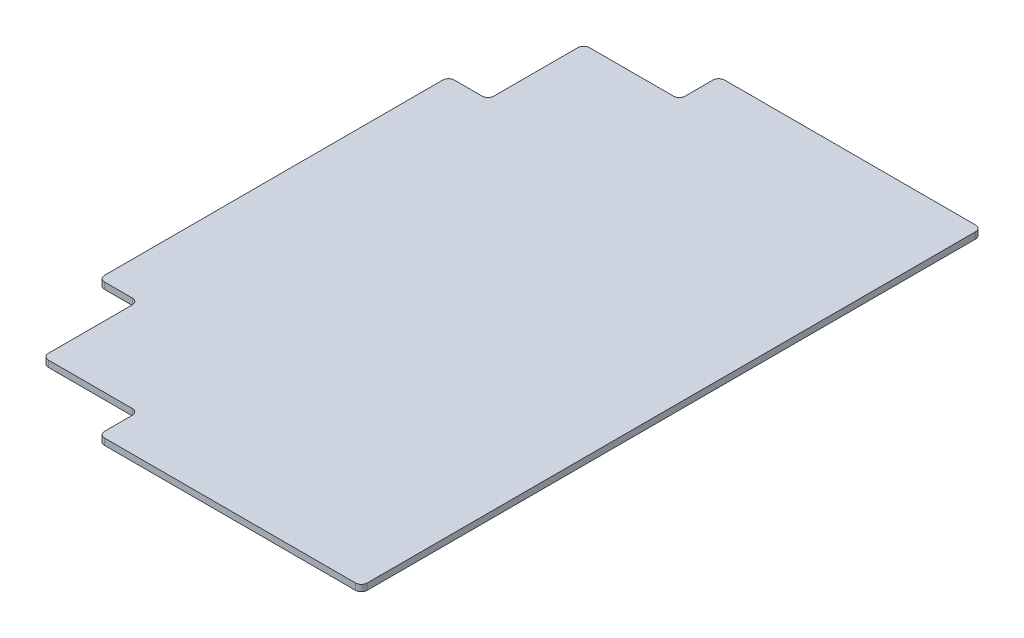
ISO-10303-21;
HEADER;
FILE_DESCRIPTION(('STEP AP214'),'2;1');
FILE_NAME('part.step','',(''),(''),'','','');
FILE_SCHEMA(('AUTOMOTIVE_DESIGN { 1 0 10303 214 1 1 1 1 }'));
ENDSEC;
DATA;
#1=APPLICATION_CONTEXT('core data for automotive mechanical design processes');
#2=APPLICATION_PROTOCOL_DEFINITION('international standard','automotive_design',2000,#1);
#3=PRODUCT_CONTEXT('',#1,'mechanical');
#4=PRODUCT('Part','Part','',(#3));
#5=PRODUCT_RELATED_PRODUCT_CATEGORY('part','',(#4));
#6=PRODUCT_DEFINITION_FORMATION('','',#4);
#7=PRODUCT_DEFINITION_CONTEXT('part definition',#1,'design');
#8=PRODUCT_DEFINITION('design','',#6,#7);
#9=PRODUCT_DEFINITION_SHAPE('','',#8);
#10=(LENGTH_UNIT() NAMED_UNIT(*) SI_UNIT(.MILLI.,.METRE.));
#11=(NAMED_UNIT(*) PLANE_ANGLE_UNIT() SI_UNIT($,.RADIAN.));
#12=(NAMED_UNIT(*) SI_UNIT($,.STERADIAN.) SOLID_ANGLE_UNIT());
#13=UNCERTAINTY_MEASURE_WITH_UNIT(LENGTH_MEASURE(1.E-05),#10,'distance_accuracy_value','');
#14=(GEOMETRIC_REPRESENTATION_CONTEXT(3) GLOBAL_UNCERTAINTY_ASSIGNED_CONTEXT((#13)) GLOBAL_UNIT_ASSIGNED_CONTEXT((#10,
#11,#12)) REPRESENTATION_CONTEXT('',''));
#15=CARTESIAN_POINT('',(0.,0.,0.));
#16=DIRECTION('',(0.,0.,1.));
#17=DIRECTION('',(1.,0.,0.));
#18=AXIS2_PLACEMENT_3D('',#15,#16,#17);
#19=CARTESIAN_POINT('',(190.5,2.778125,0.));
#20=DIRECTION('',(-1.,0.,0.));
#21=DIRECTION('',(0.,0.,1.));
#22=AXIS2_PLACEMENT_3D('',#19,#20,#21);
#23=PLANE('',#22);
#24=DIRECTION('',(0.,0.,-1.));
#25=VECTOR('',#24,1.);
#26=CARTESIAN_POINT('',(190.5,0.,0.));
#27=LINE('',#26,#25);
#28=CARTESIAN_POINT('',(190.5,0.,-20.32));
#29=VERTEX_POINT('',#28);
#30=CARTESIAN_POINT('',(190.5,0.,-284.48));
#31=VERTEX_POINT('',#30);
#32=EDGE_CURVE('E267',#29,#31,#27,.T.);
#33=ORIENTED_EDGE('',*,*,#32,.T.);
#34=DIRECTION('',(0.,1.,0.));
#35=VECTOR('',#34,1.);
#36=CARTESIAN_POINT('',(190.5,2.778125,-284.48));
#37=LINE('',#36,#35);
#38=CARTESIAN_POINT('',(190.5,2.778125,-284.48));
#39=VERTEX_POINT('',#38);
#40=EDGE_CURVE('E286',#31,#39,#37,.T.);
#41=ORIENTED_EDGE('',*,*,#40,.T.);
#42=DIRECTION('',(0.,0.,-1.));
#43=VECTOR('',#42,1.);
#44=CARTESIAN_POINT('',(190.5,2.778125,0.));
#45=LINE('',#44,#43);
#46=CARTESIAN_POINT('',(190.5,2.778125,-20.32));
#47=VERTEX_POINT('',#46);
#48=EDGE_CURVE('E276',#47,#39,#45,.T.);
#49=ORIENTED_EDGE('',*,*,#48,.F.);
#50=DIRECTION('',(0.,1.,0.));
#51=VECTOR('',#50,1.);
#52=CARTESIAN_POINT('',(190.5,2.778125,-20.32));
#53=LINE('',#52,#51);
#54=EDGE_CURVE('E284',#47,#29,#53,.F.);
#55=ORIENTED_EDGE('',*,*,#54,.T.);
#56=EDGE_LOOP('',(#33,#41,#49,#55));
#57=FACE_BOUND('',#56,.T.);
#58=ADVANCED_FACE('F33',(#57),#23,.F.);
#59=CARTESIAN_POINT('',(0.,2.778125,0.));
#60=DIRECTION('',(0.,-1.,0.));
#61=DIRECTION('',(0.,0.,-1.));
#62=AXIS2_PLACEMENT_3D('',#59,#60,#61);
#63=PLANE('',#62);
#64=ORIENTED_EDGE('',*,*,#48,.T.);
#65=CARTESIAN_POINT('',(187.96,2.778125,-284.48));
#66=DIRECTION('',(0.,-1.,0.));
#67=DIRECTION('',(0.,0.,-1.));
#68=AXIS2_PLACEMENT_3D('',#65,#66,#67);
#69=CIRCLE('',#68,2.54);
#70=CARTESIAN_POINT('',(187.96,2.778125,-287.02));
#71=VERTEX_POINT('',#70);
#72=EDGE_CURVE('E302',#39,#71,#69,.F.);
#73=ORIENTED_EDGE('',*,*,#72,.T.);
#74=DIRECTION('',(1.,0.,0.));
#75=VECTOR('',#74,1.);
#76=CARTESIAN_POINT('',(0.,2.778125,-287.02));
#77=LINE('',#76,#75);
#78=CARTESIAN_POINT('',(78.994,2.778125,-287.02));
#79=VERTEX_POINT('',#78);
#80=EDGE_CURVE('E259',#79,#71,#77,.T.);
#81=ORIENTED_EDGE('',*,*,#80,.F.);
#82=CARTESIAN_POINT('',(78.994,2.778125,-284.48));
#83=DIRECTION('',(0.,-1.,0.));
#84=DIRECTION('',(0.,0.,-1.));
#85=AXIS2_PLACEMENT_3D('',#82,#83,#84);
#86=CIRCLE('',#85,2.54);
#87=CARTESIAN_POINT('',(76.454,2.778125,-284.48));
#88=VERTEX_POINT('',#87);
#89=EDGE_CURVE('E290',#79,#88,#86,.F.);
#90=ORIENTED_EDGE('',*,*,#89,.T.);
#91=DIRECTION('',(0.,0.,-1.));
#92=VECTOR('',#91,1.);
#93=CARTESIAN_POINT('',(76.454,2.778125,-287.02));
#94=LINE('',#93,#92);
#95=CARTESIAN_POINT('',(76.454,2.778125,-272.415));
#96=VERTEX_POINT('',#95);
#97=EDGE_CURVE('E224',#96,#88,#94,.T.);
#98=ORIENTED_EDGE('',*,*,#97,.F.);
#99=CARTESIAN_POINT('',(73.914,2.778125,-272.415));
#100=DIRECTION('',(0.,-1.,0.));
#101=DIRECTION('',(0.,0.,-1.));
#102=AXIS2_PLACEMENT_3D('',#99,#100,#101);
#103=CIRCLE('',#102,2.54);
#104=CARTESIAN_POINT('',(73.914,2.778125,-269.875));
#105=VERTEX_POINT('',#104);
#106=EDGE_CURVE('E41',#96,#105,#103,.T.);
#107=ORIENTED_EDGE('',*,*,#106,.T.);
#108=DIRECTION('',(1.,0.,0.));
#109=VECTOR('',#108,1.);
#110=CARTESIAN_POINT('',(76.454,2.778125,-269.875));
#111=LINE('',#110,#109);
#112=CARTESIAN_POINT('',(37.465,2.778125,-269.875));
#113=VERTEX_POINT('',#112);
#114=EDGE_CURVE('E221',#113,#105,#111,.T.);
#115=ORIENTED_EDGE('',*,*,#114,.F.);
#116=CARTESIAN_POINT('',(37.465,2.778125,-267.335));
#117=DIRECTION('',(0.,-1.,0.));
#118=DIRECTION('',(0.,0.,-1.));
#119=AXIS2_PLACEMENT_3D('',#116,#117,#118);
#120=CIRCLE('',#119,2.54);
#121=CARTESIAN_POINT('',(34.925,2.778125,-267.335));
#122=VERTEX_POINT('',#121);
#123=EDGE_CURVE('E220',#113,#122,#120,.F.);
#124=ORIENTED_EDGE('',*,*,#123,.T.);
#125=DIRECTION('',(0.,0.,-1.));
#126=VECTOR('',#125,1.);
#127=CARTESIAN_POINT('',(34.925,2.778125,-269.875));
#128=LINE('',#127,#126);
#129=CARTESIAN_POINT('',(34.9250000000001,2.778125,-230.886));
#130=VERTEX_POINT('',#129);
#131=EDGE_CURVE('E211',#130,#122,#128,.T.);
#132=ORIENTED_EDGE('',*,*,#131,.F.);
#133=CARTESIAN_POINT('',(32.3850000000001,2.778125,-230.886));
#134=DIRECTION('',(0.,-1.,0.));
#135=DIRECTION('',(0.,0.,-1.));
#136=AXIS2_PLACEMENT_3D('',#133,#134,#135);
#137=CIRCLE('',#136,2.54);
#138=CARTESIAN_POINT('',(32.3850000000001,2.778125,-228.346));
#139=VERTEX_POINT('',#138);
#140=EDGE_CURVE('E195',#130,#139,#137,.T.);
#141=ORIENTED_EDGE('',*,*,#140,.T.);
#142=DIRECTION('',(1.,0.,0.));
#143=VECTOR('',#142,1.);
#144=CARTESIAN_POINT('',(34.9250000000001,2.778125,-228.346));
#145=LINE('',#144,#143);
#146=CARTESIAN_POINT('',(20.32,2.778125,-228.346));
#147=VERTEX_POINT('',#146);
#148=EDGE_CURVE('E222',#147,#139,#145,.T.);
#149=ORIENTED_EDGE('',*,*,#148,.F.);
#150=CARTESIAN_POINT('',(20.32,2.778125,-225.806));
#151=DIRECTION('',(0.,-1.,0.));
#152=DIRECTION('',(0.,0.,-1.));
#153=AXIS2_PLACEMENT_3D('',#150,#151,#152);
#154=CIRCLE('',#153,2.54);
#155=CARTESIAN_POINT('',(17.78,2.778125,-225.806));
#156=VERTEX_POINT('',#155);
#157=EDGE_CURVE('E292',#147,#156,#154,.F.);
#158=ORIENTED_EDGE('',*,*,#157,.T.);
#159=DIRECTION('',(0.,0.,-1.));
#160=VECTOR('',#159,1.);
#161=CARTESIAN_POINT('',(17.78,2.778125,-287.02));
#162=LINE('',#161,#160);
#163=CARTESIAN_POINT('',(17.78,2.778125,-78.994));
#164=VERTEX_POINT('',#163);
#165=EDGE_CURVE('E260',#164,#156,#162,.T.);
#166=ORIENTED_EDGE('',*,*,#165,.F.);
#167=CARTESIAN_POINT('',(20.32,2.778125,-78.994));
#168=DIRECTION('',(0.,-1.,0.));
#169=DIRECTION('',(0.,0.,-1.));
#170=AXIS2_PLACEMENT_3D('',#167,#168,#169);
#171=CIRCLE('',#170,2.54);
#172=CARTESIAN_POINT('',(20.32,2.778125,-76.454));
#173=VERTEX_POINT('',#172);
#174=EDGE_CURVE('E294',#164,#173,#171,.F.);
#175=ORIENTED_EDGE('',*,*,#174,.T.);
#176=DIRECTION('',(-1.,0.,0.));
#177=VECTOR('',#176,1.);
#178=CARTESIAN_POINT('',(34.925,2.778125,-76.454));
#179=LINE('',#178,#177);
#180=CARTESIAN_POINT('',(32.385,2.778125,-76.454));
#181=VERTEX_POINT('',#180);
#182=EDGE_CURVE('E237',#181,#173,#179,.T.);
#183=ORIENTED_EDGE('',*,*,#182,.F.);
#184=CARTESIAN_POINT('',(32.385,2.778125,-73.914));
#185=DIRECTION('',(0.,-1.,0.));
#186=DIRECTION('',(0.,0.,-1.));
#187=AXIS2_PLACEMENT_3D('',#184,#185,#186);
#188=CIRCLE('',#187,2.54);
#189=CARTESIAN_POINT('',(34.925,2.778125,-73.914));
#190=VERTEX_POINT('',#189);
#191=EDGE_CURVE('E368',#181,#190,#188,.T.);
#192=ORIENTED_EDGE('',*,*,#191,.T.);
#193=DIRECTION('',(0.,0.,-1.));
#194=VECTOR('',#193,1.);
#195=CARTESIAN_POINT('',(34.9250000000001,2.778125,-34.925));
#196=LINE('',#195,#194);
#197=CARTESIAN_POINT('',(34.9250000000001,2.778125,-37.465));
#198=VERTEX_POINT('',#197);
#199=EDGE_CURVE('E251',#198,#190,#196,.T.);
#200=ORIENTED_EDGE('',*,*,#199,.F.);
#201=CARTESIAN_POINT('',(37.4650000000001,2.778125,-37.465));
#202=DIRECTION('',(0.,-1.,0.));
#203=DIRECTION('',(0.,0.,-1.));
#204=AXIS2_PLACEMENT_3D('',#201,#202,#203);
#205=CIRCLE('',#204,2.54);
#206=CARTESIAN_POINT('',(37.4650000000001,2.778125,-34.925));
#207=VERTEX_POINT('',#206);
#208=EDGE_CURVE('E296',#198,#207,#205,.F.);
#209=ORIENTED_EDGE('',*,*,#208,.T.);
#210=DIRECTION('',(-1.,0.,0.));
#211=VECTOR('',#210,1.);
#212=CARTESIAN_POINT('',(76.454,2.778125,-34.925));
#213=LINE('',#212,#211);
#214=CARTESIAN_POINT('',(73.914,2.778125,-34.925));
#215=VERTEX_POINT('',#214);
#216=EDGE_CURVE('E248',#215,#207,#213,.T.);
#217=ORIENTED_EDGE('',*,*,#216,.F.);
#218=CARTESIAN_POINT('',(73.914,2.778125,-32.385));
#219=DIRECTION('',(0.,-1.,0.));
#220=DIRECTION('',(0.,0.,-1.));
#221=AXIS2_PLACEMENT_3D('',#218,#219,#220);
#222=CIRCLE('',#221,2.54);
#223=CARTESIAN_POINT('',(76.454,2.778125,-32.385));
#224=VERTEX_POINT('',#223);
#225=EDGE_CURVE('E364',#215,#224,#222,.T.);
#226=ORIENTED_EDGE('',*,*,#225,.T.);
#227=DIRECTION('',(0.,0.,-1.));
#228=VECTOR('',#227,1.);
#229=CARTESIAN_POINT('',(76.454,2.778125,-17.78));
#230=LINE('',#229,#228);
#231=CARTESIAN_POINT('',(76.454,2.778125,-20.32));
#232=VERTEX_POINT('',#231);
#233=EDGE_CURVE('E245',#232,#224,#230,.T.);
#234=ORIENTED_EDGE('',*,*,#233,.F.);
#235=CARTESIAN_POINT('',(78.994,2.778125,-20.32));
#236=DIRECTION('',(0.,-1.,0.));
#237=DIRECTION('',(0.,0.,-1.));
#238=AXIS2_PLACEMENT_3D('',#235,#236,#237);
#239=CIRCLE('',#238,2.54);
#240=CARTESIAN_POINT('',(78.994,2.778125,-17.78));
#241=VERTEX_POINT('',#240);
#242=EDGE_CURVE('E298',#232,#241,#239,.F.);
#243=ORIENTED_EDGE('',*,*,#242,.T.);
#244=DIRECTION('',(-1.,0.,0.));
#245=VECTOR('',#244,1.);
#246=CARTESIAN_POINT('',(0.,2.778125,-17.78));
#247=LINE('',#246,#245);
#248=CARTESIAN_POINT('',(187.96,2.778125,-17.78));
#249=VERTEX_POINT('',#248);
#250=EDGE_CURVE('E268',#249,#241,#247,.T.);
#251=ORIENTED_EDGE('',*,*,#250,.F.);
#252=CARTESIAN_POINT('',(187.96,2.778125,-20.32));
#253=DIRECTION('',(0.,-1.,0.));
#254=DIRECTION('',(0.,0.,-1.));
#255=AXIS2_PLACEMENT_3D('',#252,#253,#254);
#256=CIRCLE('',#255,2.54);
#257=EDGE_CURVE('E300',#249,#47,#256,.F.);
#258=ORIENTED_EDGE('',*,*,#257,.T.);
#259=EDGE_LOOP('',(#64,#73,#81,#90,#98,#107,#115,#124,#132,#141,#149,#158,#166,#175,#183,#192,
#200,#209,#217,#226,#234,#243,#251,#258));
#260=FACE_BOUND('',#259,.T.);
#261=ADVANCED_FACE('F218',(#260),#63,.F.);
#262=CARTESIAN_POINT('',(0.,0.,0.));
#263=DIRECTION('',(0.,-1.,0.));
#264=DIRECTION('',(0.,0.,-1.));
#265=AXIS2_PLACEMENT_3D('',#262,#263,#264);
#266=PLANE('',#265);
#267=DIRECTION('',(1.,0.,0.));
#268=VECTOR('',#267,1.);
#269=CARTESIAN_POINT('',(0.,0.,-287.02));
#270=LINE('',#269,#268);
#271=CARTESIAN_POINT('',(78.994,0.,-287.02));
#272=VERTEX_POINT('',#271);
#273=CARTESIAN_POINT('',(187.96,0.,-287.02));
#274=VERTEX_POINT('',#273);
#275=EDGE_CURVE('E271',#272,#274,#270,.T.);
#276=ORIENTED_EDGE('',*,*,#275,.T.);
#277=CARTESIAN_POINT('',(187.96,0.,-284.48));
#278=DIRECTION('',(0.,-1.,0.));
#279=DIRECTION('',(0.,0.,-1.));
#280=AXIS2_PLACEMENT_3D('',#277,#278,#279);
#281=CIRCLE('',#280,2.54);
#282=EDGE_CURVE('E322',#274,#31,#281,.T.);
#283=ORIENTED_EDGE('',*,*,#282,.T.);
#284=ORIENTED_EDGE('',*,*,#32,.F.);
#285=CARTESIAN_POINT('',(187.96,0.,-20.32));
#286=DIRECTION('',(0.,-1.,0.));
#287=DIRECTION('',(0.,0.,-1.));
#288=AXIS2_PLACEMENT_3D('',#285,#286,#287);
#289=CIRCLE('',#288,2.54);
#290=CARTESIAN_POINT('',(187.96,0.,-17.78));
#291=VERTEX_POINT('',#290);
#292=EDGE_CURVE('E320',#29,#291,#289,.T.);
#293=ORIENTED_EDGE('',*,*,#292,.T.);
#294=DIRECTION('',(-1.,0.,0.));
#295=VECTOR('',#294,1.);
#296=CARTESIAN_POINT('',(0.,0.,-17.78));
#297=LINE('',#296,#295);
#298=CARTESIAN_POINT('',(78.994,0.,-17.78));
#299=VERTEX_POINT('',#298);
#300=EDGE_CURVE('E264',#291,#299,#297,.T.);
#301=ORIENTED_EDGE('',*,*,#300,.T.);
#302=CARTESIAN_POINT('',(78.994,0.,-20.32));
#303=DIRECTION('',(0.,-1.,0.));
#304=DIRECTION('',(0.,0.,-1.));
#305=AXIS2_PLACEMENT_3D('',#302,#303,#304);
#306=CIRCLE('',#305,2.54);
#307=CARTESIAN_POINT('',(76.454,0.,-20.32));
#308=VERTEX_POINT('',#307);
#309=EDGE_CURVE('E318',#299,#308,#306,.T.);
#310=ORIENTED_EDGE('',*,*,#309,.T.);
#311=DIRECTION('',(0.,0.,-1.));
#312=VECTOR('',#311,1.);
#313=CARTESIAN_POINT('',(76.454,0.,-17.78));
#314=LINE('',#313,#312);
#315=CARTESIAN_POINT('',(76.454,0.,-32.385));
#316=VERTEX_POINT('',#315);
#317=EDGE_CURVE('E233',#308,#316,#314,.T.);
#318=ORIENTED_EDGE('',*,*,#317,.T.);
#319=CARTESIAN_POINT('',(73.914,0.,-32.385));
#320=DIRECTION('',(0.,-1.,0.));
#321=DIRECTION('',(0.,0.,-1.));
#322=AXIS2_PLACEMENT_3D('',#319,#320,#321);
#323=CIRCLE('',#322,2.54);
#324=CARTESIAN_POINT('',(73.914,0.,-34.925));
#325=VERTEX_POINT('',#324);
#326=EDGE_CURVE('E366',#316,#325,#323,.F.);
#327=ORIENTED_EDGE('',*,*,#326,.T.);
#328=DIRECTION('',(-1.,0.,0.));
#329=VECTOR('',#328,1.);
#330=CARTESIAN_POINT('',(76.454,0.,-34.925));
#331=LINE('',#330,#329);
#332=CARTESIAN_POINT('',(37.4650000000001,0.,-34.925));
#333=VERTEX_POINT('',#332);
#334=EDGE_CURVE('E236',#325,#333,#331,.T.);
#335=ORIENTED_EDGE('',*,*,#334,.T.);
#336=CARTESIAN_POINT('',(37.4650000000001,0.,-37.465));
#337=DIRECTION('',(0.,-1.,0.));
#338=DIRECTION('',(0.,0.,-1.));
#339=AXIS2_PLACEMENT_3D('',#336,#337,#338);
#340=CIRCLE('',#339,2.54);
#341=CARTESIAN_POINT('',(34.9250000000001,0.,-37.465));
#342=VERTEX_POINT('',#341);
#343=EDGE_CURVE('E316',#333,#342,#340,.T.);
#344=ORIENTED_EDGE('',*,*,#343,.T.);
#345=DIRECTION('',(0.,0.,-1.));
#346=VECTOR('',#345,1.);
#347=CARTESIAN_POINT('',(34.9250000000001,0.,-34.925));
#348=LINE('',#347,#346);
#349=CARTESIAN_POINT('',(34.925,0.,-73.914));
#350=VERTEX_POINT('',#349);
#351=EDGE_CURVE('E240',#342,#350,#348,.T.);
#352=ORIENTED_EDGE('',*,*,#351,.T.);
#353=CARTESIAN_POINT('',(32.385,0.,-73.914));
#354=DIRECTION('',(0.,-1.,0.));
#355=DIRECTION('',(0.,0.,-1.));
#356=AXIS2_PLACEMENT_3D('',#353,#354,#355);
#357=CIRCLE('',#356,2.54);
#358=CARTESIAN_POINT('',(32.385,0.,-76.454));
#359=VERTEX_POINT('',#358);
#360=EDGE_CURVE('E370',#350,#359,#357,.F.);
#361=ORIENTED_EDGE('',*,*,#360,.T.);
#362=DIRECTION('',(-1.,0.,0.));
#363=VECTOR('',#362,1.);
#364=CARTESIAN_POINT('',(34.925,0.,-76.454));
#365=LINE('',#364,#363);
#366=CARTESIAN_POINT('',(20.32,0.,-76.454));
#367=VERTEX_POINT('',#366);
#368=EDGE_CURVE('E226',#359,#367,#365,.T.);
#369=ORIENTED_EDGE('',*,*,#368,.T.);
#370=CARTESIAN_POINT('',(20.32,0.,-78.994));
#371=DIRECTION('',(0.,-1.,0.));
#372=DIRECTION('',(0.,0.,-1.));
#373=AXIS2_PLACEMENT_3D('',#370,#371,#372);
#374=CIRCLE('',#373,2.54);
#375=CARTESIAN_POINT('',(17.78,0.,-78.994));
#376=VERTEX_POINT('',#375);
#377=EDGE_CURVE('E314',#367,#376,#374,.T.);
#378=ORIENTED_EDGE('',*,*,#377,.T.);
#379=DIRECTION('',(0.,0.,-1.));
#380=VECTOR('',#379,1.);
#381=CARTESIAN_POINT('',(17.78,0.,-287.02));
#382=LINE('',#381,#380);
#383=CARTESIAN_POINT('',(17.78,0.,-225.806));
#384=VERTEX_POINT('',#383);
#385=EDGE_CURVE('E256',#376,#384,#382,.T.);
#386=ORIENTED_EDGE('',*,*,#385,.T.);
#387=CARTESIAN_POINT('',(20.32,0.,-225.806));
#388=DIRECTION('',(0.,-1.,0.));
#389=DIRECTION('',(0.,0.,-1.));
#390=AXIS2_PLACEMENT_3D('',#387,#388,#389);
#391=CIRCLE('',#390,2.54);
#392=CARTESIAN_POINT('',(20.32,0.,-228.346));
#393=VERTEX_POINT('',#392);
#394=EDGE_CURVE('E312',#384,#393,#391,.T.);
#395=ORIENTED_EDGE('',*,*,#394,.T.);
#396=DIRECTION('',(1.,0.,0.));
#397=VECTOR('',#396,1.);
#398=CARTESIAN_POINT('',(34.9250000000001,0.,-228.346));
#399=LINE('',#398,#397);
#400=CARTESIAN_POINT('',(32.3850000000001,0.,-228.346));
#401=VERTEX_POINT('',#400);
#402=EDGE_CURVE('E232',#393,#401,#399,.T.);
#403=ORIENTED_EDGE('',*,*,#402,.T.);
#404=CARTESIAN_POINT('',(32.3850000000001,0.,-230.886));
#405=DIRECTION('',(0.,-1.,0.));
#406=DIRECTION('',(0.,0.,-1.));
#407=AXIS2_PLACEMENT_3D('',#404,#405,#406);
#408=CIRCLE('',#407,2.54);
#409=CARTESIAN_POINT('',(34.9250000000001,0.,-230.886));
#410=VERTEX_POINT('',#409);
#411=EDGE_CURVE('E205',#401,#410,#408,.F.);
#412=ORIENTED_EDGE('',*,*,#411,.T.);
#413=DIRECTION('',(0.,0.,-1.));
#414=VECTOR('',#413,1.);
#415=CARTESIAN_POINT('',(34.925,0.,-269.875));
#416=LINE('',#415,#414);
#417=CARTESIAN_POINT('',(34.925,0.,-267.335));
#418=VERTEX_POINT('',#417);
#419=EDGE_CURVE('E213',#410,#418,#416,.T.);
#420=ORIENTED_EDGE('',*,*,#419,.T.);
#421=CARTESIAN_POINT('',(37.465,0.,-267.335));
#422=DIRECTION('',(0.,-1.,0.));
#423=DIRECTION('',(0.,0.,-1.));
#424=AXIS2_PLACEMENT_3D('',#421,#422,#423);
#425=CIRCLE('',#424,2.54);
#426=CARTESIAN_POINT('',(37.465,0.,-269.875));
#427=VERTEX_POINT('',#426);
#428=EDGE_CURVE('E55',#418,#427,#425,.T.);
#429=ORIENTED_EDGE('',*,*,#428,.T.);
#430=DIRECTION('',(1.,0.,0.));
#431=VECTOR('',#430,1.);
#432=CARTESIAN_POINT('',(76.454,0.,-269.875));
#433=LINE('',#432,#431);
#434=CARTESIAN_POINT('',(73.914,0.,-269.875));
#435=VERTEX_POINT('',#434);
#436=EDGE_CURVE('E382',#427,#435,#433,.T.);
#437=ORIENTED_EDGE('',*,*,#436,.T.);
#438=CARTESIAN_POINT('',(73.914,0.,-272.415));
#439=DIRECTION('',(0.,-1.,0.));
#440=DIRECTION('',(0.,0.,-1.));
#441=AXIS2_PLACEMENT_3D('',#438,#439,#440);
#442=CIRCLE('',#441,2.54);
#443=CARTESIAN_POINT('',(76.454,0.,-272.415));
#444=VERTEX_POINT('',#443);
#445=EDGE_CURVE('E11',#435,#444,#442,.F.);
#446=ORIENTED_EDGE('',*,*,#445,.T.);
#447=DIRECTION('',(0.,0.,-1.));
#448=VECTOR('',#447,1.);
#449=CARTESIAN_POINT('',(76.454,0.,-287.02));
#450=LINE('',#449,#448);
#451=CARTESIAN_POINT('',(76.454,0.,-284.48));
#452=VERTEX_POINT('',#451);
#453=EDGE_CURVE('E263',#444,#452,#450,.T.);
#454=ORIENTED_EDGE('',*,*,#453,.T.);
#455=CARTESIAN_POINT('',(78.994,0.,-284.48));
#456=DIRECTION('',(0.,-1.,0.));
#457=DIRECTION('',(0.,0.,-1.));
#458=AXIS2_PLACEMENT_3D('',#455,#456,#457);
#459=CIRCLE('',#458,2.54);
#460=EDGE_CURVE('E310',#452,#272,#459,.T.);
#461=ORIENTED_EDGE('',*,*,#460,.T.);
#462=EDGE_LOOP('',(#276,#283,#284,#293,#301,#310,#318,#327,#335,#344,#352,#361,#369,#378,#386,
#395,#403,#412,#420,#429,#437,#446,#454,#461));
#463=FACE_BOUND('',#462,.T.);
#464=ADVANCED_FACE('F380',(#463),#266,.T.);
#465=CARTESIAN_POINT('',(0.,0.,-287.02));
#466=DIRECTION('',(0.,0.,1.));
#467=DIRECTION('',(1.,0.,0.));
#468=AXIS2_PLACEMENT_3D('',#465,#466,#467);
#469=PLANE('',#468);
#470=ORIENTED_EDGE('',*,*,#80,.T.);
#471=DIRECTION('',(0.,1.,0.));
#472=VECTOR('',#471,1.);
#473=CARTESIAN_POINT('',(187.96,0.,-287.02));
#474=LINE('',#473,#472);
#475=EDGE_CURVE('E307',#71,#274,#474,.F.);
#476=ORIENTED_EDGE('',*,*,#475,.T.);
#477=ORIENTED_EDGE('',*,*,#275,.F.);
#478=DIRECTION('',(0.,1.,0.));
#479=VECTOR('',#478,1.);
#480=CARTESIAN_POINT('',(78.994,0.,-287.02));
#481=LINE('',#480,#479);
#482=EDGE_CURVE('E304',#272,#79,#481,.T.);
#483=ORIENTED_EDGE('',*,*,#482,.T.);
#484=EDGE_LOOP('',(#470,#476,#477,#483));
#485=FACE_BOUND('',#484,.T.);
#486=ADVANCED_FACE('F462',(#485),#469,.F.);
#487=CARTESIAN_POINT('',(0.,0.,-17.78));
#488=DIRECTION('',(0.,0.,-1.));
#489=DIRECTION('',(-1.,0.,0.));
#490=AXIS2_PLACEMENT_3D('',#487,#488,#489);
#491=PLANE('',#490);
#492=ORIENTED_EDGE('',*,*,#300,.F.);
#493=DIRECTION('',(0.,1.,0.));
#494=VECTOR('',#493,1.);
#495=CARTESIAN_POINT('',(187.96,0.,-17.78));
#496=LINE('',#495,#494);
#497=EDGE_CURVE('E326',#291,#249,#496,.T.);
#498=ORIENTED_EDGE('',*,*,#497,.T.);
#499=ORIENTED_EDGE('',*,*,#250,.T.);
#500=DIRECTION('',(0.,1.,0.));
#501=VECTOR('',#500,1.);
#502=CARTESIAN_POINT('',(78.994,0.,-17.78));
#503=LINE('',#502,#501);
#504=EDGE_CURVE('E324',#241,#299,#503,.F.);
#505=ORIENTED_EDGE('',*,*,#504,.T.);
#506=EDGE_LOOP('',(#492,#498,#499,#505));
#507=FACE_BOUND('',#506,.T.);
#508=ADVANCED_FACE('F446',(#507),#491,.F.);
#509=CARTESIAN_POINT('',(17.78,0.,-287.02));
#510=DIRECTION('',(1.,0.,0.));
#511=DIRECTION('',(0.,0.,-1.));
#512=AXIS2_PLACEMENT_3D('',#509,#510,#511);
#513=PLANE('',#512);
#514=ORIENTED_EDGE('',*,*,#385,.F.);
#515=DIRECTION('',(0.,1.,0.));
#516=VECTOR('',#515,1.);
#517=CARTESIAN_POINT('',(17.78,0.,-78.994));
#518=LINE('',#517,#516);
#519=EDGE_CURVE('E351',#376,#164,#518,.T.);
#520=ORIENTED_EDGE('',*,*,#519,.T.);
#521=ORIENTED_EDGE('',*,*,#165,.T.);
#522=DIRECTION('',(0.,1.,0.));
#523=VECTOR('',#522,1.);
#524=CARTESIAN_POINT('',(17.78,0.,-225.806));
#525=LINE('',#524,#523);
#526=EDGE_CURVE('E349',#156,#384,#525,.F.);
#527=ORIENTED_EDGE('',*,*,#526,.T.);
#528=EDGE_LOOP('',(#514,#520,#521,#527));
#529=FACE_BOUND('',#528,.T.);
#530=ADVANCED_FACE('F401',(#529),#513,.F.);
#531=CARTESIAN_POINT('',(34.925,0.,-76.454));
#532=DIRECTION('',(0.,0.,-1.));
#533=DIRECTION('',(-1.,0.,0.));
#534=AXIS2_PLACEMENT_3D('',#531,#532,#533);
#535=PLANE('',#534);
#536=ORIENTED_EDGE('',*,*,#368,.F.);
#537=DIRECTION('',(0.,1.,0.));
#538=VECTOR('',#537,1.);
#539=CARTESIAN_POINT('',(32.385,2.778125,-76.454));
#540=LINE('',#539,#538);
#541=EDGE_CURVE('E346',#359,#181,#540,.T.);
#542=ORIENTED_EDGE('',*,*,#541,.T.);
#543=ORIENTED_EDGE('',*,*,#182,.T.);
#544=DIRECTION('',(0.,1.,0.));
#545=VECTOR('',#544,1.);
#546=CARTESIAN_POINT('',(20.32,0.,-76.454));
#547=LINE('',#546,#545);
#548=EDGE_CURVE('E344',#173,#367,#547,.F.);
#549=ORIENTED_EDGE('',*,*,#548,.T.);
#550=EDGE_LOOP('',(#536,#542,#543,#549));
#551=FACE_BOUND('',#550,.T.);
#552=ADVANCED_FACE('F410',(#551),#535,.F.);
#553=CARTESIAN_POINT('',(34.9250000000001,0.,-34.925));
#554=DIRECTION('',(1.,0.,0.));
#555=DIRECTION('',(0.,0.,-1.));
#556=AXIS2_PLACEMENT_3D('',#553,#554,#555);
#557=PLANE('',#556);
#558=ORIENTED_EDGE('',*,*,#351,.F.);
#559=DIRECTION('',(0.,1.,0.));
#560=VECTOR('',#559,1.);
#561=CARTESIAN_POINT('',(34.9250000000001,0.,-37.465));
#562=LINE('',#561,#560);
#563=EDGE_CURVE('E341',#342,#198,#562,.T.);
#564=ORIENTED_EDGE('',*,*,#563,.T.);
#565=ORIENTED_EDGE('',*,*,#199,.T.);
#566=DIRECTION('',(0.,1.,0.));
#567=VECTOR('',#566,1.);
#568=CARTESIAN_POINT('',(34.925,0.,-73.914));
#569=LINE('',#568,#567);
#570=EDGE_CURVE('E339',#190,#350,#569,.F.);
#571=ORIENTED_EDGE('',*,*,#570,.T.);
#572=EDGE_LOOP('',(#558,#564,#565,#571));
#573=FACE_BOUND('',#572,.T.);
#574=ADVANCED_FACE('F419',(#573),#557,.F.);
#575=CARTESIAN_POINT('',(76.454,0.,-34.925));
#576=DIRECTION('',(0.,0.,-1.));
#577=DIRECTION('',(-1.,0.,0.));
#578=AXIS2_PLACEMENT_3D('',#575,#576,#577);
#579=PLANE('',#578);
#580=ORIENTED_EDGE('',*,*,#334,.F.);
#581=DIRECTION('',(0.,1.,0.));
#582=VECTOR('',#581,1.);
#583=CARTESIAN_POINT('',(73.914,2.778125,-34.925));
#584=LINE('',#583,#582);
#585=EDGE_CURVE('E336',#325,#215,#584,.T.);
#586=ORIENTED_EDGE('',*,*,#585,.T.);
#587=ORIENTED_EDGE('',*,*,#216,.T.);
#588=DIRECTION('',(0.,1.,0.));
#589=VECTOR('',#588,1.);
#590=CARTESIAN_POINT('',(37.4650000000001,0.,-34.925));
#591=LINE('',#590,#589);
#592=EDGE_CURVE('E334',#207,#333,#591,.F.);
#593=ORIENTED_EDGE('',*,*,#592,.T.);
#594=EDGE_LOOP('',(#580,#586,#587,#593));
#595=FACE_BOUND('',#594,.T.);
#596=ADVANCED_FACE('F428',(#595),#579,.F.);
#597=CARTESIAN_POINT('',(76.454,0.,-17.78));
#598=DIRECTION('',(1.,0.,0.));
#599=DIRECTION('',(0.,0.,-1.));
#600=AXIS2_PLACEMENT_3D('',#597,#598,#599);
#601=PLANE('',#600);
#602=ORIENTED_EDGE('',*,*,#317,.F.);
#603=DIRECTION('',(0.,1.,0.));
#604=VECTOR('',#603,1.);
#605=CARTESIAN_POINT('',(76.454,0.,-20.32));
#606=LINE('',#605,#604);
#607=EDGE_CURVE('E331',#308,#232,#606,.T.);
#608=ORIENTED_EDGE('',*,*,#607,.T.);
#609=ORIENTED_EDGE('',*,*,#233,.T.);
#610=DIRECTION('',(0.,1.,0.));
#611=VECTOR('',#610,1.);
#612=CARTESIAN_POINT('',(76.454,0.,-32.385));
#613=LINE('',#612,#611);
#614=EDGE_CURVE('E329',#224,#316,#613,.F.);
#615=ORIENTED_EDGE('',*,*,#614,.T.);
#616=EDGE_LOOP('',(#602,#608,#609,#615));
#617=FACE_BOUND('',#616,.T.);
#618=ADVANCED_FACE('F437',(#617),#601,.F.);
#619=CARTESIAN_POINT('',(76.454,0.,-287.02));
#620=DIRECTION('',(1.,0.,0.));
#621=DIRECTION('',(0.,0.,-1.));
#622=AXIS2_PLACEMENT_3D('',#619,#620,#621);
#623=PLANE('',#622);
#624=ORIENTED_EDGE('',*,*,#97,.T.);
#625=DIRECTION('',(0.,1.,0.));
#626=VECTOR('',#625,1.);
#627=CARTESIAN_POINT('',(76.454,0.,-284.48));
#628=LINE('',#627,#626);
#629=EDGE_CURVE('E357',#88,#452,#628,.F.);
#630=ORIENTED_EDGE('',*,*,#629,.T.);
#631=ORIENTED_EDGE('',*,*,#453,.F.);
#632=DIRECTION('',(0.,1.,0.));
#633=VECTOR('',#632,1.);
#634=CARTESIAN_POINT('',(76.454,2.778125,-272.415));
#635=LINE('',#634,#633);
#636=EDGE_CURVE('E354',#444,#96,#635,.T.);
#637=ORIENTED_EDGE('',*,*,#636,.T.);
#638=EDGE_LOOP('',(#624,#630,#631,#637));
#639=FACE_BOUND('',#638,.T.);
#640=ADVANCED_FACE('F384',(#639),#623,.F.);
#641=CARTESIAN_POINT('',(76.454,0.,-269.875));
#642=DIRECTION('',(0.,0.,1.));
#643=DIRECTION('',(1.,0.,0.));
#644=AXIS2_PLACEMENT_3D('',#641,#642,#643);
#645=PLANE('',#644);
#646=ORIENTED_EDGE('',*,*,#114,.T.);
#647=DIRECTION('',(0.,1.,0.));
#648=VECTOR('',#647,1.);
#649=CARTESIAN_POINT('',(73.914,0.,-269.875));
#650=LINE('',#649,#648);
#651=EDGE_CURVE('E48',#105,#435,#650,.F.);
#652=ORIENTED_EDGE('',*,*,#651,.T.);
#653=ORIENTED_EDGE('',*,*,#436,.F.);
#654=DIRECTION('',(0.,1.,0.));
#655=VECTOR('',#654,1.);
#656=CARTESIAN_POINT('',(37.465,0.,-269.875));
#657=LINE('',#656,#655);
#658=EDGE_CURVE('E359',#427,#113,#657,.T.);
#659=ORIENTED_EDGE('',*,*,#658,.T.);
#660=EDGE_LOOP('',(#646,#652,#653,#659));
#661=FACE_BOUND('',#660,.T.);
#662=ADVANCED_FACE('F374',(#661),#645,.F.);
#663=CARTESIAN_POINT('',(34.925,0.,-269.875));
#664=DIRECTION('',(1.,0.,0.));
#665=DIRECTION('',(0.,0.,-1.));
#666=AXIS2_PLACEMENT_3D('',#663,#664,#665);
#667=PLANE('',#666);
#668=ORIENTED_EDGE('',*,*,#419,.F.);
#669=DIRECTION('',(0.,1.,0.));
#670=VECTOR('',#669,1.);
#671=CARTESIAN_POINT('',(34.9250000000001,2.778125,-230.886));
#672=LINE('',#671,#670);
#673=EDGE_CURVE('E199',#410,#130,#672,.T.);
#674=ORIENTED_EDGE('',*,*,#673,.T.);
#675=ORIENTED_EDGE('',*,*,#131,.T.);
#676=DIRECTION('',(0.,1.,0.));
#677=VECTOR('',#676,1.);
#678=CARTESIAN_POINT('',(34.925,0.,-267.335));
#679=LINE('',#678,#677);
#680=EDGE_CURVE('E215',#122,#418,#679,.F.);
#681=ORIENTED_EDGE('',*,*,#680,.T.);
#682=EDGE_LOOP('',(#668,#674,#675,#681));
#683=FACE_BOUND('',#682,.T.);
#684=ADVANCED_FACE('F210',(#683),#667,.F.);
#685=CARTESIAN_POINT('',(34.9250000000001,0.,-228.346));
#686=DIRECTION('',(0.,0.,1.));
#687=DIRECTION('',(1.,0.,0.));
#688=AXIS2_PLACEMENT_3D('',#685,#686,#687);
#689=PLANE('',#688);
#690=ORIENTED_EDGE('',*,*,#148,.T.);
#691=DIRECTION('',(0.,1.,0.));
#692=VECTOR('',#691,1.);
#693=CARTESIAN_POINT('',(32.3850000000001,0.,-228.346));
#694=LINE('',#693,#692);
#695=EDGE_CURVE('E200',#139,#401,#694,.F.);
#696=ORIENTED_EDGE('',*,*,#695,.T.);
#697=ORIENTED_EDGE('',*,*,#402,.F.);
#698=DIRECTION('',(0.,1.,0.));
#699=VECTOR('',#698,1.);
#700=CARTESIAN_POINT('',(20.32,0.,-228.346));
#701=LINE('',#700,#699);
#702=EDGE_CURVE('E214',#393,#147,#701,.T.);
#703=ORIENTED_EDGE('',*,*,#702,.T.);
#704=EDGE_LOOP('',(#690,#696,#697,#703));
#705=FACE_BOUND('',#704,.T.);
#706=ADVANCED_FACE('F394',(#705),#689,.F.);
#707=CARTESIAN_POINT('',(32.3850000000001,0.,-230.886));
#708=DIRECTION('',(0.,-1.,0.));
#709=DIRECTION('',(0.,0.,-1.));
#710=AXIS2_PLACEMENT_3D('',#707,#708,#709);
#711=CYLINDRICAL_SURFACE('',#710,2.54);
#712=ORIENTED_EDGE('',*,*,#411,.F.);
#713=ORIENTED_EDGE('',*,*,#695,.F.);
#714=ORIENTED_EDGE('',*,*,#140,.F.);
#715=ORIENTED_EDGE('',*,*,#673,.F.);
#716=EDGE_LOOP('',(#712,#713,#714,#715));
#717=FACE_BOUND('',#716,.T.);
#718=ADVANCED_FACE('F198',(#717),#711,.F.);
#719=CARTESIAN_POINT('',(187.96,2.778125,-284.48));
#720=DIRECTION('',(0.,1.,0.));
#721=DIRECTION('',(0.,0.,1.));
#722=AXIS2_PLACEMENT_3D('',#719,#720,#721);
#723=CYLINDRICAL_SURFACE('',#722,2.54);
#724=ORIENTED_EDGE('',*,*,#282,.F.);
#725=ORIENTED_EDGE('',*,*,#475,.F.);
#726=ORIENTED_EDGE('',*,*,#72,.F.);
#727=ORIENTED_EDGE('',*,*,#40,.F.);
#728=EDGE_LOOP('',(#724,#725,#726,#727));
#729=FACE_BOUND('',#728,.T.);
#730=ADVANCED_FACE('F458',(#729),#723,.T.);
#731=CARTESIAN_POINT('',(187.96,0.,-20.32));
#732=DIRECTION('',(0.,1.,0.));
#733=DIRECTION('',(0.,0.,1.));
#734=AXIS2_PLACEMENT_3D('',#731,#732,#733);
#735=CYLINDRICAL_SURFACE('',#734,2.54);
#736=ORIENTED_EDGE('',*,*,#292,.F.);
#737=ORIENTED_EDGE('',*,*,#54,.F.);
#738=ORIENTED_EDGE('',*,*,#257,.F.);
#739=ORIENTED_EDGE('',*,*,#497,.F.);
#740=EDGE_LOOP('',(#736,#737,#738,#739));
#741=FACE_BOUND('',#740,.T.);
#742=ADVANCED_FACE('F450',(#741),#735,.T.);
#743=CARTESIAN_POINT('',(78.994,0.,-20.32));
#744=DIRECTION('',(0.,1.,0.));
#745=DIRECTION('',(0.,0.,1.));
#746=AXIS2_PLACEMENT_3D('',#743,#744,#745);
#747=CYLINDRICAL_SURFACE('',#746,2.54);
#748=ORIENTED_EDGE('',*,*,#309,.F.);
#749=ORIENTED_EDGE('',*,*,#504,.F.);
#750=ORIENTED_EDGE('',*,*,#242,.F.);
#751=ORIENTED_EDGE('',*,*,#607,.F.);
#752=EDGE_LOOP('',(#748,#749,#750,#751));
#753=FACE_BOUND('',#752,.T.);
#754=ADVANCED_FACE('F441',(#753),#747,.T.);
#755=CARTESIAN_POINT('',(73.914,0.,-32.385));
#756=DIRECTION('',(0.,-1.,0.));
#757=DIRECTION('',(0.,0.,-1.));
#758=AXIS2_PLACEMENT_3D('',#755,#756,#757);
#759=CYLINDRICAL_SURFACE('',#758,2.54);
#760=ORIENTED_EDGE('',*,*,#326,.F.);
#761=ORIENTED_EDGE('',*,*,#614,.F.);
#762=ORIENTED_EDGE('',*,*,#225,.F.);
#763=ORIENTED_EDGE('',*,*,#585,.F.);
#764=EDGE_LOOP('',(#760,#761,#762,#763));
#765=FACE_BOUND('',#764,.T.);
#766=ADVANCED_FACE('F432',(#765),#759,.F.);
#767=CARTESIAN_POINT('',(37.4650000000001,0.,-37.465));
#768=DIRECTION('',(0.,1.,0.));
#769=DIRECTION('',(0.,0.,1.));
#770=AXIS2_PLACEMENT_3D('',#767,#768,#769);
#771=CYLINDRICAL_SURFACE('',#770,2.54);
#772=ORIENTED_EDGE('',*,*,#343,.F.);
#773=ORIENTED_EDGE('',*,*,#592,.F.);
#774=ORIENTED_EDGE('',*,*,#208,.F.);
#775=ORIENTED_EDGE('',*,*,#563,.F.);
#776=EDGE_LOOP('',(#772,#773,#774,#775));
#777=FACE_BOUND('',#776,.T.);
#778=ADVANCED_FACE('F423',(#777),#771,.T.);
#779=CARTESIAN_POINT('',(32.385,0.,-73.914));
#780=DIRECTION('',(0.,-1.,0.));
#781=DIRECTION('',(0.,0.,-1.));
#782=AXIS2_PLACEMENT_3D('',#779,#780,#781);
#783=CYLINDRICAL_SURFACE('',#782,2.54);
#784=ORIENTED_EDGE('',*,*,#360,.F.);
#785=ORIENTED_EDGE('',*,*,#570,.F.);
#786=ORIENTED_EDGE('',*,*,#191,.F.);
#787=ORIENTED_EDGE('',*,*,#541,.F.);
#788=EDGE_LOOP('',(#784,#785,#786,#787));
#789=FACE_BOUND('',#788,.T.);
#790=ADVANCED_FACE('F414',(#789),#783,.F.);
#791=CARTESIAN_POINT('',(20.32,0.,-78.994));
#792=DIRECTION('',(0.,1.,0.));
#793=DIRECTION('',(0.,0.,1.));
#794=AXIS2_PLACEMENT_3D('',#791,#792,#793);
#795=CYLINDRICAL_SURFACE('',#794,2.54);
#796=ORIENTED_EDGE('',*,*,#377,.F.);
#797=ORIENTED_EDGE('',*,*,#548,.F.);
#798=ORIENTED_EDGE('',*,*,#174,.F.);
#799=ORIENTED_EDGE('',*,*,#519,.F.);
#800=EDGE_LOOP('',(#796,#797,#798,#799));
#801=FACE_BOUND('',#800,.T.);
#802=ADVANCED_FACE('F405',(#801),#795,.T.);
#803=CARTESIAN_POINT('',(20.32,0.,-225.806));
#804=DIRECTION('',(0.,1.,0.));
#805=DIRECTION('',(0.,0.,1.));
#806=AXIS2_PLACEMENT_3D('',#803,#804,#805);
#807=CYLINDRICAL_SURFACE('',#806,2.54);
#808=ORIENTED_EDGE('',*,*,#394,.F.);
#809=ORIENTED_EDGE('',*,*,#526,.F.);
#810=ORIENTED_EDGE('',*,*,#157,.F.);
#811=ORIENTED_EDGE('',*,*,#702,.F.);
#812=EDGE_LOOP('',(#808,#809,#810,#811));
#813=FACE_BOUND('',#812,.T.);
#814=ADVANCED_FACE('F396',(#813),#807,.T.);
#815=CARTESIAN_POINT('',(78.994,0.,-284.48));
#816=DIRECTION('',(0.,1.,0.));
#817=DIRECTION('',(0.,0.,1.));
#818=AXIS2_PLACEMENT_3D('',#815,#816,#817);
#819=CYLINDRICAL_SURFACE('',#818,2.54);
#820=ORIENTED_EDGE('',*,*,#460,.F.);
#821=ORIENTED_EDGE('',*,*,#629,.F.);
#822=ORIENTED_EDGE('',*,*,#89,.F.);
#823=ORIENTED_EDGE('',*,*,#482,.F.);
#824=EDGE_LOOP('',(#820,#821,#822,#823));
#825=FACE_BOUND('',#824,.T.);
#826=ADVANCED_FACE('F466',(#825),#819,.T.);
#827=CARTESIAN_POINT('',(73.914,0.,-272.415));
#828=DIRECTION('',(0.,-1.,0.));
#829=DIRECTION('',(0.,0.,-1.));
#830=AXIS2_PLACEMENT_3D('',#827,#828,#829);
#831=CYLINDRICAL_SURFACE('',#830,2.54);
#832=ORIENTED_EDGE('',*,*,#445,.F.);
#833=ORIENTED_EDGE('',*,*,#651,.F.);
#834=ORIENTED_EDGE('',*,*,#106,.F.);
#835=ORIENTED_EDGE('',*,*,#636,.F.);
#836=EDGE_LOOP('',(#832,#833,#834,#835));
#837=FACE_BOUND('',#836,.T.);
#838=ADVANCED_FACE('F377',(#837),#831,.F.);
#839=CARTESIAN_POINT('',(37.465,0.,-267.335));
#840=DIRECTION('',(0.,1.,0.));
#841=DIRECTION('',(0.,0.,1.));
#842=AXIS2_PLACEMENT_3D('',#839,#840,#841);
#843=CYLINDRICAL_SURFACE('',#842,2.54);
#844=ORIENTED_EDGE('',*,*,#428,.F.);
#845=ORIENTED_EDGE('',*,*,#680,.F.);
#846=ORIENTED_EDGE('',*,*,#123,.F.);
#847=ORIENTED_EDGE('',*,*,#658,.F.);
#848=EDGE_LOOP('',(#844,#845,#846,#847));
#849=FACE_BOUND('',#848,.T.);
#850=ADVANCED_FACE('F35',(#849),#843,.T.);
#851=CLOSED_SHELL('',(#58,#261,#464,#486,#508,#530,#552,#574,#596,#618,#640,#662,#684,#706,#718,
#730,#742,#754,#766,#778,#790,#802,#814,#826,#838,#850));
#852=MANIFOLD_SOLID_BREP('B2',#851);
#853=ADVANCED_BREP_SHAPE_REPRESENTATION('',(#18,#852),#14);
#854=SHAPE_DEFINITION_REPRESENTATION(#9,#853);
ENDSEC;
END-ISO-10303-21;
